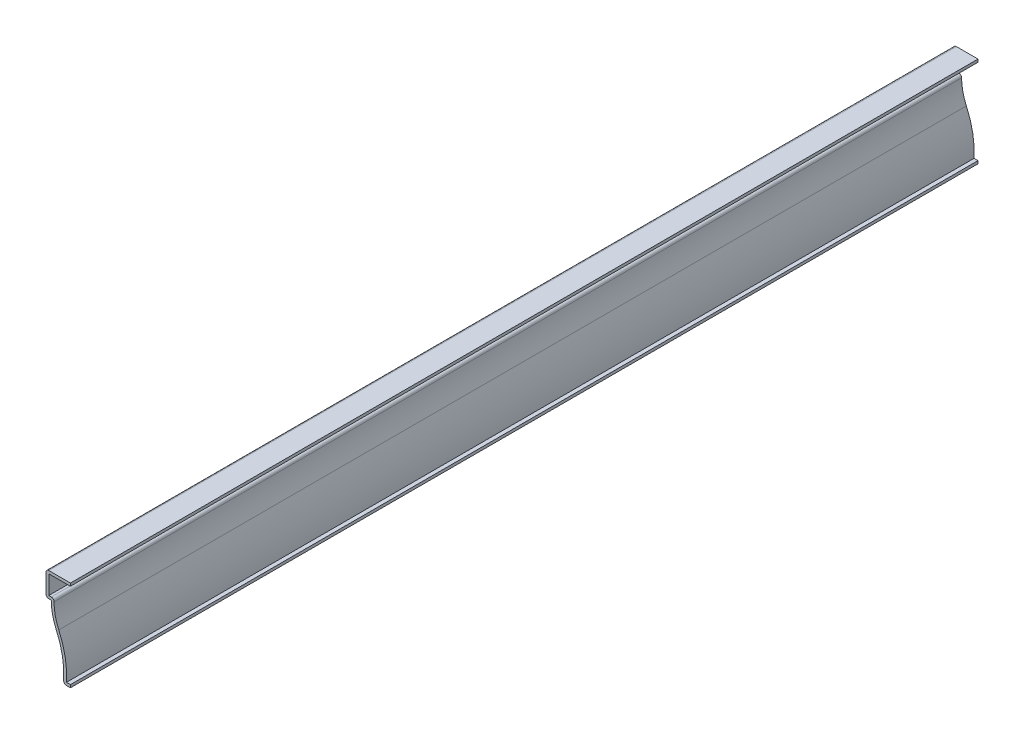
ISO-10303-21;
HEADER;
FILE_DESCRIPTION(('STEP AP214'),'2;1');
FILE_NAME('part.step','',(''),(''),'','','');
FILE_SCHEMA(('AUTOMOTIVE_DESIGN { 1 0 10303 214 1 1 1 1 }'));
ENDSEC;
DATA;
#1=APPLICATION_CONTEXT('core data for automotive mechanical design processes');
#2=APPLICATION_PROTOCOL_DEFINITION('international standard','automotive_design',2000,#1);
#3=PRODUCT_CONTEXT('',#1,'mechanical');
#4=PRODUCT('Part','Part','',(#3));
#5=PRODUCT_RELATED_PRODUCT_CATEGORY('part','',(#4));
#6=PRODUCT_DEFINITION_FORMATION('','',#4);
#7=PRODUCT_DEFINITION_CONTEXT('part definition',#1,'design');
#8=PRODUCT_DEFINITION('design','',#6,#7);
#9=PRODUCT_DEFINITION_SHAPE('','',#8);
#10=(LENGTH_UNIT() NAMED_UNIT(*) SI_UNIT(.MILLI.,.METRE.));
#11=(NAMED_UNIT(*) PLANE_ANGLE_UNIT() SI_UNIT($,.RADIAN.));
#12=(NAMED_UNIT(*) SI_UNIT($,.STERADIAN.) SOLID_ANGLE_UNIT());
#13=UNCERTAINTY_MEASURE_WITH_UNIT(LENGTH_MEASURE(1.E-05),#10,'distance_accuracy_value','');
#14=(GEOMETRIC_REPRESENTATION_CONTEXT(3) GLOBAL_UNCERTAINTY_ASSIGNED_CONTEXT((#13)) GLOBAL_UNIT_ASSIGNED_CONTEXT((#10,
#11,#12)) REPRESENTATION_CONTEXT('',''));
#15=CARTESIAN_POINT('',(0.,0.,0.));
#16=DIRECTION('',(0.,0.,1.));
#17=DIRECTION('',(1.,0.,0.));
#18=AXIS2_PLACEMENT_3D('',#15,#16,#17);
#19=CARTESIAN_POINT('',(-11.1125,40.005,-412.75));
#20=DIRECTION('',(0.,-1.,0.));
#21=DIRECTION('',(0.,0.,-1.));
#22=AXIS2_PLACEMENT_3D('',#19,#20,#21);
#23=PLANE('',#22);
#24=DIRECTION('',(1.,0.,0.));
#25=VECTOR('',#24,1.);
#26=CARTESIAN_POINT('',(-11.1125,40.005,0.));
#27=LINE('',#26,#25);
#28=CARTESIAN_POINT('',(-9.8425,40.005,0.));
#29=VERTEX_POINT('',#28);
#30=CARTESIAN_POINT('',(0.,40.005,0.));
#31=VERTEX_POINT('',#30);
#32=EDGE_CURVE('E218',#29,#31,#27,.T.);
#33=ORIENTED_EDGE('',*,*,#32,.F.);
#34=DIRECTION('',(0.,0.,1.));
#35=VECTOR('',#34,1.);
#36=CARTESIAN_POINT('',(-9.8425,40.005,-412.75));
#37=LINE('',#36,#35);
#38=CARTESIAN_POINT('',(-9.8425,40.005,-412.75));
#39=VERTEX_POINT('',#38);
#40=EDGE_CURVE('E185',#39,#29,#37,.T.);
#41=ORIENTED_EDGE('',*,*,#40,.F.);
#42=DIRECTION('',(1.,0.,0.));
#43=VECTOR('',#42,1.);
#44=CARTESIAN_POINT('',(-11.1125,40.005,-412.75));
#45=LINE('',#44,#43);
#46=CARTESIAN_POINT('',(0.,40.005,-412.75));
#47=VERTEX_POINT('',#46);
#48=EDGE_CURVE('E167',#39,#47,#45,.T.);
#49=ORIENTED_EDGE('',*,*,#48,.T.);
#50=DIRECTION('',(0.,0.,1.));
#51=VECTOR('',#50,1.);
#52=CARTESIAN_POINT('',(0.,40.005,-412.75));
#53=LINE('',#52,#51);
#54=EDGE_CURVE('E175',#47,#31,#53,.T.);
#55=ORIENTED_EDGE('',*,*,#54,.T.);
#56=EDGE_LOOP('',(#33,#41,#49,#55));
#57=FACE_BOUND('',#56,.T.);
#58=ADVANCED_FACE('F35',(#57),#23,.T.);
#59=CARTESIAN_POINT('',(-9.8425,30.1625,-412.75));
#60=DIRECTION('',(1.,0.,0.));
#61=DIRECTION('',(0.,0.,-1.));
#62=AXIS2_PLACEMENT_3D('',#59,#60,#61);
#63=PLANE('',#62);
#64=DIRECTION('',(0.,1.,0.));
#65=VECTOR('',#64,1.);
#66=CARTESIAN_POINT('',(-9.8425,30.1625,0.));
#67=LINE('',#66,#65);
#68=CARTESIAN_POINT('',(-9.8425,31.4325,0.));
#69=VERTEX_POINT('',#68);
#70=EDGE_CURVE('E186',#69,#29,#67,.T.);
#71=ORIENTED_EDGE('',*,*,#70,.F.);
#72=DIRECTION('',(0.,0.,1.));
#73=VECTOR('',#72,1.);
#74=CARTESIAN_POINT('',(-9.8425,31.4325,-412.75));
#75=LINE('',#74,#73);
#76=CARTESIAN_POINT('',(-9.8425,31.4325,-412.75));
#77=VERTEX_POINT('',#76);
#78=EDGE_CURVE('E249',#77,#69,#75,.T.);
#79=ORIENTED_EDGE('',*,*,#78,.F.);
#80=DIRECTION('',(0.,1.,0.));
#81=VECTOR('',#80,1.);
#82=CARTESIAN_POINT('',(-9.8425,30.1625,-412.75));
#83=LINE('',#82,#81);
#84=EDGE_CURVE('E183',#77,#39,#83,.T.);
#85=ORIENTED_EDGE('',*,*,#84,.T.);
#86=ORIENTED_EDGE('',*,*,#40,.T.);
#87=EDGE_LOOP('',(#71,#79,#85,#86));
#88=FACE_BOUND('',#87,.T.);
#89=ADVANCED_FACE('F320',(#88),#63,.T.);
#90=CARTESIAN_POINT('',(-8.73125,31.4325,-412.75));
#91=DIRECTION('',(0.,1.,0.));
#92=DIRECTION('',(-1.,0.,0.));
#93=AXIS2_PLACEMENT_3D('',#90,#91,#92);
#94=PLANE('',#93);
#95=DIRECTION('',(-1.,0.,0.));
#96=VECTOR('',#95,1.);
#97=CARTESIAN_POINT('',(-8.73125,31.4325,0.));
#98=LINE('',#97,#96);
#99=CARTESIAN_POINT('',(-8.73125,31.4325,0.));
#100=VERTEX_POINT('',#99);
#101=EDGE_CURVE('E189',#100,#69,#98,.T.);
#102=ORIENTED_EDGE('',*,*,#101,.F.);
#103=DIRECTION('',(0.,0.,1.));
#104=VECTOR('',#103,1.);
#105=CARTESIAN_POINT('',(-8.73125,31.4325,-412.75));
#106=LINE('',#105,#104);
#107=CARTESIAN_POINT('',(-8.73125,31.4325,-412.75));
#108=VERTEX_POINT('',#107);
#109=EDGE_CURVE('E290',#100,#108,#106,.F.);
#110=ORIENTED_EDGE('',*,*,#109,.T.);
#111=DIRECTION('',(-1.,0.,0.));
#112=VECTOR('',#111,1.);
#113=CARTESIAN_POINT('',(-8.73125,31.4325,-412.75));
#114=LINE('',#113,#112);
#115=EDGE_CURVE('E215',#108,#77,#114,.T.);
#116=ORIENTED_EDGE('',*,*,#115,.T.);
#117=ORIENTED_EDGE('',*,*,#78,.T.);
#118=EDGE_LOOP('',(#102,#110,#116,#117));
#119=FACE_BOUND('',#118,.T.);
#120=ADVANCED_FACE('F374',(#119),#94,.T.);
#121=CARTESIAN_POINT('',(16.66875,30.1625,-412.75));
#122=DIRECTION('',(0.,0.,1.));
#123=DIRECTION('',(1.,0.,0.));
#124=AXIS2_PLACEMENT_3D('',#121,#122,#123);
#125=CYLINDRICAL_SURFACE('',#124,24.13);
#126=CARTESIAN_POINT('',(16.66875,30.1625,-412.75));
#127=DIRECTION('',(0.,0.,1.));
#128=DIRECTION('',(1.,0.,0.));
#129=AXIS2_PLACEMENT_3D('',#126,#127,#128);
#130=CIRCLE('',#129,24.13);
#131=CARTESIAN_POINT('',(-5.2955052227266,20.1710840587569,-412.75));
#132=VERTEX_POINT('',#131);
#133=CARTESIAN_POINT('',(-7.46125,30.1625,-412.75));
#134=VERTEX_POINT('',#133);
#135=EDGE_CURVE('E212',#132,#134,#130,.F.);
#136=ORIENTED_EDGE('',*,*,#135,.T.);
#137=DIRECTION('',(0.,0.,1.));
#138=VECTOR('',#137,1.);
#139=CARTESIAN_POINT('',(-7.46125,30.1625,-412.75));
#140=LINE('',#139,#138);
#141=CARTESIAN_POINT('',(-7.46125,30.1625,0.));
#142=VERTEX_POINT('',#141);
#143=EDGE_CURVE('E287',#134,#142,#140,.T.);
#144=ORIENTED_EDGE('',*,*,#143,.T.);
#145=CARTESIAN_POINT('',(16.66875,30.1625,0.));
#146=DIRECTION('',(0.,0.,1.));
#147=DIRECTION('',(1.,0.,0.));
#148=AXIS2_PLACEMENT_3D('',#145,#146,#147);
#149=CIRCLE('',#148,24.13);
#150=CARTESIAN_POINT('',(-5.2955052227266,20.1710840587569,0.));
#151=VERTEX_POINT('',#150);
#152=EDGE_CURVE('E243',#151,#142,#149,.F.);
#153=ORIENTED_EDGE('',*,*,#152,.F.);
#154=DIRECTION('',(0.,0.,1.));
#155=VECTOR('',#154,1.);
#156=CARTESIAN_POINT('',(-5.2955052227266,20.1710840587569,-412.75));
#157=LINE('',#156,#155);
#158=EDGE_CURVE('E252',#132,#151,#157,.T.);
#159=ORIENTED_EDGE('',*,*,#158,.F.);
#160=EDGE_LOOP('',(#136,#144,#153,#159));
#161=FACE_BOUND('',#160,.T.);
#162=ADVANCED_FACE('F331',(#161),#125,.F.);
#163=CARTESIAN_POINT('',(-41.4931758364964,3.70496765558977,-412.75));
#164=DIRECTION('',(0.,0.,1.));
#165=DIRECTION('',(1.,0.,0.));
#166=AXIS2_PLACEMENT_3D('',#163,#164,#165);
#167=CYLINDRICAL_SURFACE('',#166,39.766875);
#168=CARTESIAN_POINT('',(-41.4931758364964,3.70496765558977,0.));
#169=DIRECTION('',(0.,0.,1.));
#170=DIRECTION('',(1.,0.,0.));
#171=AXIS2_PLACEMENT_3D('',#168,#169,#170);
#172=CIRCLE('',#171,39.766875);
#173=CARTESIAN_POINT('',(-1.80091865978933,1.27,0.));
#174=VERTEX_POINT('',#173);
#175=EDGE_CURVE('E240',#174,#151,#172,.T.);
#176=ORIENTED_EDGE('',*,*,#175,.F.);
#177=DIRECTION('',(0.,0.,1.));
#178=VECTOR('',#177,1.);
#179=CARTESIAN_POINT('',(-1.80091865978933,1.27,-412.75));
#180=LINE('',#179,#178);
#181=CARTESIAN_POINT('',(-1.80091865978933,1.27,-412.75));
#182=VERTEX_POINT('',#181);
#183=EDGE_CURVE('E254',#182,#174,#180,.T.);
#184=ORIENTED_EDGE('',*,*,#183,.F.);
#185=CARTESIAN_POINT('',(-41.4931758364964,3.70496765558977,-412.75));
#186=DIRECTION('',(0.,0.,1.));
#187=DIRECTION('',(1.,0.,0.));
#188=AXIS2_PLACEMENT_3D('',#185,#186,#187);
#189=CIRCLE('',#188,39.766875);
#190=EDGE_CURVE('E209',#182,#132,#189,.T.);
#191=ORIENTED_EDGE('',*,*,#190,.T.);
#192=ORIENTED_EDGE('',*,*,#158,.T.);
#193=EDGE_LOOP('',(#176,#184,#191,#192));
#194=FACE_BOUND('',#193,.T.);
#195=ADVANCED_FACE('F336',(#194),#167,.T.);
#196=CARTESIAN_POINT('',(0.,1.27,-412.75));
#197=DIRECTION('',(0.,1.,0.));
#198=DIRECTION('',(-1.,0.,0.));
#199=AXIS2_PLACEMENT_3D('',#196,#197,#198);
#200=PLANE('',#199);
#201=DIRECTION('',(-1.,0.,0.));
#202=VECTOR('',#201,1.);
#203=CARTESIAN_POINT('',(0.,1.27,0.));
#204=LINE('',#203,#202);
#205=CARTESIAN_POINT('',(0.,1.27,0.));
#206=VERTEX_POINT('',#205);
#207=EDGE_CURVE('E237',#206,#174,#204,.T.);
#208=ORIENTED_EDGE('',*,*,#207,.F.);
#209=DIRECTION('',(0.,0.,1.));
#210=VECTOR('',#209,1.);
#211=CARTESIAN_POINT('',(0.,1.27,-412.75));
#212=LINE('',#211,#210);
#213=CARTESIAN_POINT('',(0.,1.27,-412.75));
#214=VERTEX_POINT('',#213);
#215=EDGE_CURVE('E256',#214,#206,#212,.T.);
#216=ORIENTED_EDGE('',*,*,#215,.F.);
#217=DIRECTION('',(-1.,0.,0.));
#218=VECTOR('',#217,1.);
#219=CARTESIAN_POINT('',(0.,1.27,-412.75));
#220=LINE('',#219,#218);
#221=EDGE_CURVE('E206',#214,#182,#220,.T.);
#222=ORIENTED_EDGE('',*,*,#221,.T.);
#223=ORIENTED_EDGE('',*,*,#183,.T.);
#224=EDGE_LOOP('',(#208,#216,#222,#223));
#225=FACE_BOUND('',#224,.T.);
#226=ADVANCED_FACE('F340',(#225),#200,.T.);
#227=CARTESIAN_POINT('',(0.,1.27,-412.75));
#228=DIRECTION('',(-1.,0.,0.));
#229=DIRECTION('',(0.,-1.,0.));
#230=AXIS2_PLACEMENT_3D('',#227,#228,#229);
#231=PLANE('',#230);
#232=DIRECTION('',(0.,-1.,0.));
#233=VECTOR('',#232,1.);
#234=CARTESIAN_POINT('',(0.,1.27,0.));
#235=LINE('',#234,#233);
#236=CARTESIAN_POINT('',(0.,0.,0.));
#237=VERTEX_POINT('',#236);
#238=EDGE_CURVE('E235',#206,#237,#235,.T.);
#239=ORIENTED_EDGE('',*,*,#238,.T.);
#240=DIRECTION('',(0.,0.,1.));
#241=VECTOR('',#240,1.);
#242=CARTESIAN_POINT('',(0.,0.,-412.75));
#243=LINE('',#242,#241);
#244=CARTESIAN_POINT('',(0.,0.,-412.75));
#245=VERTEX_POINT('',#244);
#246=EDGE_CURVE('E258',#245,#237,#243,.T.);
#247=ORIENTED_EDGE('',*,*,#246,.F.);
#248=DIRECTION('',(0.,-1.,0.));
#249=VECTOR('',#248,1.);
#250=CARTESIAN_POINT('',(0.,1.27,-412.75));
#251=LINE('',#250,#249);
#252=EDGE_CURVE('E204',#214,#245,#251,.T.);
#253=ORIENTED_EDGE('',*,*,#252,.F.);
#254=ORIENTED_EDGE('',*,*,#215,.T.);
#255=EDGE_LOOP('',(#239,#247,#253,#254));
#256=FACE_BOUND('',#255,.T.);
#257=ADVANCED_FACE('F344',(#256),#231,.F.);
#258=CARTESIAN_POINT('',(0.,0.,-412.75));
#259=DIRECTION('',(0.,1.,0.));
#260=DIRECTION('',(-1.,0.,0.));
#261=AXIS2_PLACEMENT_3D('',#258,#259,#260);
#262=PLANE('',#261);
#263=DIRECTION('',(-1.,0.,0.));
#264=VECTOR('',#263,1.);
#265=CARTESIAN_POINT('',(0.,0.,0.));
#266=LINE('',#265,#264);
#267=CARTESIAN_POINT('',(-1.80091865978933,0.,0.));
#268=VERTEX_POINT('',#267);
#269=EDGE_CURVE('E232',#237,#268,#266,.T.);
#270=ORIENTED_EDGE('',*,*,#269,.T.);
#271=DIRECTION('',(0.,0.,1.));
#272=VECTOR('',#271,1.);
#273=CARTESIAN_POINT('',(-1.80091865978933,0.,-412.75));
#274=LINE('',#273,#272);
#275=CARTESIAN_POINT('',(-1.80091865978933,0.,-412.75));
#276=VERTEX_POINT('',#275);
#277=EDGE_CURVE('E278',#268,#276,#274,.F.);
#278=ORIENTED_EDGE('',*,*,#277,.T.);
#279=DIRECTION('',(-1.,0.,0.));
#280=VECTOR('',#279,1.);
#281=CARTESIAN_POINT('',(0.,0.,-412.75));
#282=LINE('',#281,#280);
#283=EDGE_CURVE('E202',#245,#276,#282,.T.);
#284=ORIENTED_EDGE('',*,*,#283,.F.);
#285=ORIENTED_EDGE('',*,*,#246,.T.);
#286=EDGE_LOOP('',(#270,#278,#284,#285));
#287=FACE_BOUND('',#286,.T.);
#288=ADVANCED_FACE('F367',(#287),#262,.F.);
#289=CARTESIAN_POINT('',(-41.4931758364964,3.70496765558977,-412.75));
#290=DIRECTION('',(0.,0.,1.));
#291=DIRECTION('',(1.,0.,0.));
#292=AXIS2_PLACEMENT_3D('',#289,#290,#291);
#293=CYLINDRICAL_SURFACE('',#292,38.496875);
#294=CARTESIAN_POINT('',(-41.4931758364964,3.70496765558977,-412.75));
#295=DIRECTION('',(0.,0.,1.));
#296=DIRECTION('',(1.,0.,0.));
#297=AXIS2_PLACEMENT_3D('',#294,#295,#296);
#298=CIRCLE('',#297,38.496875);
#299=CARTESIAN_POINT('',(-3.06853565545263,1.34776343810267,-412.75));
#300=VERTEX_POINT('',#299);
#301=CARTESIAN_POINT('',(-6.45151865550168,19.6452200618493,-412.75));
#302=VERTEX_POINT('',#301);
#303=EDGE_CURVE('E200',#300,#302,#298,.T.);
#304=ORIENTED_EDGE('',*,*,#303,.F.);
#305=DIRECTION('',(0.,0.,1.));
#306=VECTOR('',#305,1.);
#307=CARTESIAN_POINT('',(-3.06853565545262,1.34776343810267,-412.75));
#308=LINE('',#307,#306);
#309=CARTESIAN_POINT('',(-3.06853565545263,1.34776343810267,0.));
#310=VERTEX_POINT('',#309);
#311=EDGE_CURVE('E248',#300,#310,#308,.T.);
#312=ORIENTED_EDGE('',*,*,#311,.T.);
#313=CARTESIAN_POINT('',(-41.4931758364964,3.70496765558977,0.));
#314=DIRECTION('',(0.,0.,1.));
#315=DIRECTION('',(1.,0.,0.));
#316=AXIS2_PLACEMENT_3D('',#313,#314,#315);
#317=CIRCLE('',#316,38.496875);
#318=CARTESIAN_POINT('',(-6.45151865550168,19.6452200618493,0.));
#319=VERTEX_POINT('',#318);
#320=EDGE_CURVE('E230',#310,#319,#317,.T.);
#321=ORIENTED_EDGE('',*,*,#320,.T.);
#322=DIRECTION('',(0.,0.,1.));
#323=VECTOR('',#322,1.);
#324=CARTESIAN_POINT('',(-6.45151865550168,19.6452200618493,-412.75));
#325=LINE('',#324,#323);
#326=EDGE_CURVE('E261',#302,#319,#325,.T.);
#327=ORIENTED_EDGE('',*,*,#326,.F.);
#328=EDGE_LOOP('',(#304,#312,#321,#327));
#329=FACE_BOUND('',#328,.T.);
#330=ADVANCED_FACE('F354',(#329),#293,.F.);
#331=CARTESIAN_POINT('',(16.66875,30.1625,-412.75));
#332=DIRECTION('',(0.,0.,1.));
#333=DIRECTION('',(1.,0.,0.));
#334=AXIS2_PLACEMENT_3D('',#331,#332,#333);
#335=CYLINDRICAL_SURFACE('',#334,25.4);
#336=CARTESIAN_POINT('',(16.66875,30.1625,0.));
#337=DIRECTION('',(0.,0.,-1.));
#338=DIRECTION('',(-1.,0.,0.));
#339=AXIS2_PLACEMENT_3D('',#336,#337,#338);
#340=CIRCLE('',#339,25.4);
#341=CARTESIAN_POINT('',(-8.73125,30.1625,0.));
#342=VERTEX_POINT('',#341);
#343=EDGE_CURVE('E228',#319,#342,#340,.T.);
#344=ORIENTED_EDGE('',*,*,#343,.T.);
#345=DIRECTION('',(0.,0.,1.));
#346=VECTOR('',#345,1.);
#347=CARTESIAN_POINT('',(-8.73125,30.1625,-412.75));
#348=LINE('',#347,#346);
#349=CARTESIAN_POINT('',(-8.73125,30.1625,-412.75));
#350=VERTEX_POINT('',#349);
#351=EDGE_CURVE('E264',#350,#342,#348,.T.);
#352=ORIENTED_EDGE('',*,*,#351,.F.);
#353=CARTESIAN_POINT('',(16.66875,30.1625,-412.75));
#354=DIRECTION('',(0.,0.,-1.));
#355=DIRECTION('',(-1.,0.,0.));
#356=AXIS2_PLACEMENT_3D('',#353,#354,#355);
#357=CIRCLE('',#356,25.4);
#358=EDGE_CURVE('E198',#302,#350,#357,.T.);
#359=ORIENTED_EDGE('',*,*,#358,.F.);
#360=ORIENTED_EDGE('',*,*,#326,.T.);
#361=EDGE_LOOP('',(#344,#352,#359,#360));
#362=FACE_BOUND('',#361,.T.);
#363=ADVANCED_FACE('F359',(#362),#335,.T.);
#364=CARTESIAN_POINT('',(-8.73125,30.1625,-412.75));
#365=DIRECTION('',(0.,1.,0.));
#366=DIRECTION('',(-1.,0.,0.));
#367=AXIS2_PLACEMENT_3D('',#364,#365,#366);
#368=PLANE('',#367);
#369=DIRECTION('',(-1.,0.,0.));
#370=VECTOR('',#369,1.);
#371=CARTESIAN_POINT('',(-8.73125,30.1625,0.));
#372=LINE('',#371,#370);
#373=CARTESIAN_POINT('',(-9.8425,30.1625,0.));
#374=VERTEX_POINT('',#373);
#375=EDGE_CURVE('E225',#342,#374,#372,.T.);
#376=ORIENTED_EDGE('',*,*,#375,.T.);
#377=DIRECTION('',(0.,0.,1.));
#378=VECTOR('',#377,1.);
#379=CARTESIAN_POINT('',(-9.8425,30.1625,-412.75));
#380=LINE('',#379,#378);
#381=CARTESIAN_POINT('',(-9.8425,30.1625,-412.75));
#382=VERTEX_POINT('',#381);
#383=EDGE_CURVE('E43',#374,#382,#380,.F.);
#384=ORIENTED_EDGE('',*,*,#383,.T.);
#385=DIRECTION('',(-1.,0.,0.));
#386=VECTOR('',#385,1.);
#387=CARTESIAN_POINT('',(-8.73125,30.1625,-412.75));
#388=LINE('',#387,#386);
#389=EDGE_CURVE('E195',#350,#382,#388,.T.);
#390=ORIENTED_EDGE('',*,*,#389,.F.);
#391=ORIENTED_EDGE('',*,*,#351,.T.);
#392=EDGE_LOOP('',(#376,#384,#390,#391));
#393=FACE_BOUND('',#392,.T.);
#394=ADVANCED_FACE('F298',(#393),#368,.F.);
#395=CARTESIAN_POINT('',(-11.1125,30.1625,-412.75));
#396=DIRECTION('',(1.,0.,0.));
#397=DIRECTION('',(0.,0.,-1.));
#398=AXIS2_PLACEMENT_3D('',#395,#396,#397);
#399=PLANE('',#398);
#400=DIRECTION('',(0.,1.,0.));
#401=VECTOR('',#400,1.);
#402=CARTESIAN_POINT('',(-11.1125,30.1625,-412.75));
#403=LINE('',#402,#401);
#404=CARTESIAN_POINT('',(-11.1125,31.4325,-412.75));
#405=VERTEX_POINT('',#404);
#406=CARTESIAN_POINT('',(-11.1125,40.005,-412.75));
#407=VERTEX_POINT('',#406);
#408=EDGE_CURVE('E193',#405,#407,#403,.T.);
#409=ORIENTED_EDGE('',*,*,#408,.F.);
#410=DIRECTION('',(0.,0.,1.));
#411=VECTOR('',#410,1.);
#412=CARTESIAN_POINT('',(-11.1125,31.4325,-412.75));
#413=LINE('',#412,#411);
#414=CARTESIAN_POINT('',(-11.1125,31.4325,0.));
#415=VERTEX_POINT('',#414);
#416=EDGE_CURVE('E293',#405,#415,#413,.T.);
#417=ORIENTED_EDGE('',*,*,#416,.T.);
#418=DIRECTION('',(0.,1.,0.));
#419=VECTOR('',#418,1.);
#420=CARTESIAN_POINT('',(-11.1125,30.1625,0.));
#421=LINE('',#420,#419);
#422=CARTESIAN_POINT('',(-11.1125,40.005,0.));
#423=VERTEX_POINT('',#422);
#424=EDGE_CURVE('E223',#415,#423,#421,.T.);
#425=ORIENTED_EDGE('',*,*,#424,.T.);
#426=DIRECTION('',(0.,0.,1.));
#427=VECTOR('',#426,1.);
#428=CARTESIAN_POINT('',(-11.1125,40.005,-412.75));
#429=LINE('',#428,#427);
#430=EDGE_CURVE('E58',#423,#407,#429,.F.);
#431=ORIENTED_EDGE('',*,*,#430,.T.);
#432=EDGE_LOOP('',(#409,#417,#425,#431));
#433=FACE_BOUND('',#432,.T.);
#434=ADVANCED_FACE('F307',(#433),#399,.F.);
#435=CARTESIAN_POINT('',(-11.1125,41.275,-412.75));
#436=DIRECTION('',(0.,-1.,0.));
#437=DIRECTION('',(0.,0.,-1.));
#438=AXIS2_PLACEMENT_3D('',#435,#436,#437);
#439=PLANE('',#438);
#440=DIRECTION('',(1.,0.,0.));
#441=VECTOR('',#440,1.);
#442=CARTESIAN_POINT('',(-11.1125,41.275,-412.75));
#443=LINE('',#442,#441);
#444=CARTESIAN_POINT('',(-9.8425,41.275,-412.75));
#445=VERTEX_POINT('',#444);
#446=CARTESIAN_POINT('',(0.,41.275,-412.75));
#447=VERTEX_POINT('',#446);
#448=EDGE_CURVE('E169',#445,#447,#443,.T.);
#449=ORIENTED_EDGE('',*,*,#448,.F.);
#450=DIRECTION('',(0.,0.,1.));
#451=VECTOR('',#450,1.);
#452=CARTESIAN_POINT('',(-9.8425,41.275,-412.75));
#453=LINE('',#452,#451);
#454=CARTESIAN_POINT('',(-9.8425,41.275,0.));
#455=VERTEX_POINT('',#454);
#456=EDGE_CURVE('E11',#445,#455,#453,.T.);
#457=ORIENTED_EDGE('',*,*,#456,.T.);
#458=DIRECTION('',(1.,0.,0.));
#459=VECTOR('',#458,1.);
#460=CARTESIAN_POINT('',(-11.1125,41.275,0.));
#461=LINE('',#460,#459);
#462=CARTESIAN_POINT('',(0.,41.275,0.));
#463=VERTEX_POINT('',#462);
#464=EDGE_CURVE('E221',#455,#463,#461,.T.);
#465=ORIENTED_EDGE('',*,*,#464,.T.);
#466=DIRECTION('',(0.,0.,1.));
#467=VECTOR('',#466,1.);
#468=CARTESIAN_POINT('',(0.,41.275,-412.75));
#469=LINE('',#468,#467);
#470=EDGE_CURVE('E182',#447,#463,#469,.T.);
#471=ORIENTED_EDGE('',*,*,#470,.F.);
#472=EDGE_LOOP('',(#449,#457,#465,#471));
#473=FACE_BOUND('',#472,.T.);
#474=ADVANCED_FACE('F315',(#473),#439,.F.);
#475=CARTESIAN_POINT('',(0.,41.275,-412.75));
#476=DIRECTION('',(-1.,0.,0.));
#477=DIRECTION('',(0.,0.,1.));
#478=AXIS2_PLACEMENT_3D('',#475,#476,#477);
#479=PLANE('',#478);
#480=DIRECTION('',(0.,-1.,0.));
#481=VECTOR('',#480,1.);
#482=CARTESIAN_POINT('',(0.,41.275,0.));
#483=LINE('',#482,#481);
#484=EDGE_CURVE('E178',#463,#31,#483,.T.);
#485=ORIENTED_EDGE('',*,*,#484,.T.);
#486=ORIENTED_EDGE('',*,*,#54,.F.);
#487=DIRECTION('',(0.,-1.,0.));
#488=VECTOR('',#487,1.);
#489=CARTESIAN_POINT('',(0.,41.275,-412.75));
#490=LINE('',#489,#488);
#491=EDGE_CURVE('E161',#447,#47,#490,.T.);
#492=ORIENTED_EDGE('',*,*,#491,.F.);
#493=ORIENTED_EDGE('',*,*,#470,.T.);
#494=EDGE_LOOP('',(#485,#486,#492,#493));
#495=FACE_BOUND('',#494,.T.);
#496=ADVANCED_FACE('F176',(#495),#479,.F.);
#497=CARTESIAN_POINT('',(16.66875,30.1625,-412.75));
#498=DIRECTION('',(0.,0.,-1.));
#499=DIRECTION('',(-1.,0.,0.));
#500=AXIS2_PLACEMENT_3D('',#497,#498,#499);
#501=PLANE('',#500);
#502=ORIENTED_EDGE('',*,*,#283,.T.);
#503=CARTESIAN_POINT('',(-1.80091865978933,1.27,-412.75));
#504=DIRECTION('',(0.,0.,-1.));
#505=DIRECTION('',(-1.,0.,0.));
#506=AXIS2_PLACEMENT_3D('',#503,#504,#505);
#507=CIRCLE('',#506,1.27);
#508=EDGE_CURVE('E285',#276,#300,#507,.T.);
#509=ORIENTED_EDGE('',*,*,#508,.T.);
#510=ORIENTED_EDGE('',*,*,#303,.T.);
#511=ORIENTED_EDGE('',*,*,#358,.T.);
#512=ORIENTED_EDGE('',*,*,#389,.T.);
#513=CARTESIAN_POINT('',(-9.8425,31.4325,-412.75));
#514=DIRECTION('',(0.,0.,-1.));
#515=DIRECTION('',(-1.,0.,0.));
#516=AXIS2_PLACEMENT_3D('',#513,#514,#515);
#517=CIRCLE('',#516,1.27);
#518=EDGE_CURVE('E281',#382,#405,#517,.T.);
#519=ORIENTED_EDGE('',*,*,#518,.T.);
#520=ORIENTED_EDGE('',*,*,#408,.T.);
#521=CARTESIAN_POINT('',(-9.8425,40.005,-412.75));
#522=DIRECTION('',(0.,0.,-1.));
#523=DIRECTION('',(-1.,0.,0.));
#524=AXIS2_PLACEMENT_3D('',#521,#522,#523);
#525=CIRCLE('',#524,1.27);
#526=EDGE_CURVE('E50',#407,#445,#525,.T.);
#527=ORIENTED_EDGE('',*,*,#526,.T.);
#528=ORIENTED_EDGE('',*,*,#448,.T.);
#529=ORIENTED_EDGE('',*,*,#491,.T.);
#530=ORIENTED_EDGE('',*,*,#48,.F.);
#531=ORIENTED_EDGE('',*,*,#84,.F.);
#532=ORIENTED_EDGE('',*,*,#115,.F.);
#533=CARTESIAN_POINT('',(-8.73125,30.1625,-412.75));
#534=DIRECTION('',(0.,0.,-1.));
#535=DIRECTION('',(-1.,0.,0.));
#536=AXIS2_PLACEMENT_3D('',#533,#534,#535);
#537=CIRCLE('',#536,1.27);
#538=EDGE_CURVE('E283',#108,#134,#537,.T.);
#539=ORIENTED_EDGE('',*,*,#538,.T.);
#540=ORIENTED_EDGE('',*,*,#135,.F.);
#541=ORIENTED_EDGE('',*,*,#190,.F.);
#542=ORIENTED_EDGE('',*,*,#221,.F.);
#543=ORIENTED_EDGE('',*,*,#252,.T.);
#544=EDGE_LOOP('',(#502,#509,#510,#511,#512,#519,#520,#527,#528,#529,#530,#531,#532,#539,#540,
#541,#542,#543));
#545=FACE_BOUND('',#544,.T.);
#546=ADVANCED_FACE('F164',(#545),#501,.T.);
#547=CARTESIAN_POINT('',(16.66875,30.1625,0.));
#548=DIRECTION('',(0.,0.,-1.));
#549=DIRECTION('',(-1.,0.,0.));
#550=AXIS2_PLACEMENT_3D('',#547,#548,#549);
#551=PLANE('',#550);
#552=ORIENTED_EDGE('',*,*,#320,.F.);
#553=CARTESIAN_POINT('',(-1.80091865978933,1.27,0.));
#554=DIRECTION('',(0.,0.,-1.));
#555=DIRECTION('',(-1.,0.,0.));
#556=AXIS2_PLACEMENT_3D('',#553,#554,#555);
#557=CIRCLE('',#556,1.27);
#558=EDGE_CURVE('E276',#310,#268,#557,.F.);
#559=ORIENTED_EDGE('',*,*,#558,.T.);
#560=ORIENTED_EDGE('',*,*,#269,.F.);
#561=ORIENTED_EDGE('',*,*,#238,.F.);
#562=ORIENTED_EDGE('',*,*,#207,.T.);
#563=ORIENTED_EDGE('',*,*,#175,.T.);
#564=ORIENTED_EDGE('',*,*,#152,.T.);
#565=CARTESIAN_POINT('',(-8.73125,30.1625,0.));
#566=DIRECTION('',(0.,0.,-1.));
#567=DIRECTION('',(-1.,0.,0.));
#568=AXIS2_PLACEMENT_3D('',#565,#566,#567);
#569=CIRCLE('',#568,1.27);
#570=EDGE_CURVE('E274',#142,#100,#569,.F.);
#571=ORIENTED_EDGE('',*,*,#570,.T.);
#572=ORIENTED_EDGE('',*,*,#101,.T.);
#573=ORIENTED_EDGE('',*,*,#70,.T.);
#574=ORIENTED_EDGE('',*,*,#32,.T.);
#575=ORIENTED_EDGE('',*,*,#484,.F.);
#576=ORIENTED_EDGE('',*,*,#464,.F.);
#577=CARTESIAN_POINT('',(-9.8425,40.005,0.));
#578=DIRECTION('',(0.,0.,-1.));
#579=DIRECTION('',(-1.,0.,0.));
#580=AXIS2_PLACEMENT_3D('',#577,#578,#579);
#581=CIRCLE('',#580,1.27);
#582=EDGE_CURVE('E270',#455,#423,#581,.F.);
#583=ORIENTED_EDGE('',*,*,#582,.T.);
#584=ORIENTED_EDGE('',*,*,#424,.F.);
#585=CARTESIAN_POINT('',(-9.8425,31.4325,0.));
#586=DIRECTION('',(0.,0.,-1.));
#587=DIRECTION('',(-1.,0.,0.));
#588=AXIS2_PLACEMENT_3D('',#585,#586,#587);
#589=CIRCLE('',#588,1.27);
#590=EDGE_CURVE('E272',#415,#374,#589,.F.);
#591=ORIENTED_EDGE('',*,*,#590,.T.);
#592=ORIENTED_EDGE('',*,*,#375,.F.);
#593=ORIENTED_EDGE('',*,*,#343,.F.);
#594=EDGE_LOOP('',(#552,#559,#560,#561,#562,#563,#564,#571,#572,#573,#574,#575,#576,#583,#584,
#591,#592,#593));
#595=FACE_BOUND('',#594,.T.);
#596=ADVANCED_FACE('F310',(#595),#551,.F.);
#597=CARTESIAN_POINT('',(-1.80091865978933,1.27,-412.75));
#598=DIRECTION('',(0.,0.,1.));
#599=DIRECTION('',(1.,0.,0.));
#600=AXIS2_PLACEMENT_3D('',#597,#598,#599);
#601=CYLINDRICAL_SURFACE('',#600,1.27);
#602=ORIENTED_EDGE('',*,*,#508,.F.);
#603=ORIENTED_EDGE('',*,*,#277,.F.);
#604=ORIENTED_EDGE('',*,*,#558,.F.);
#605=ORIENTED_EDGE('',*,*,#311,.F.);
#606=EDGE_LOOP('',(#602,#603,#604,#605));
#607=FACE_BOUND('',#606,.T.);
#608=ADVANCED_FACE('F352',(#607),#601,.T.);
#609=CARTESIAN_POINT('',(-8.73125,30.1625,-412.75));
#610=DIRECTION('',(0.,0.,1.));
#611=DIRECTION('',(1.,0.,0.));
#612=AXIS2_PLACEMENT_3D('',#609,#610,#611);
#613=CYLINDRICAL_SURFACE('',#612,1.27);
#614=ORIENTED_EDGE('',*,*,#538,.F.);
#615=ORIENTED_EDGE('',*,*,#109,.F.);
#616=ORIENTED_EDGE('',*,*,#570,.F.);
#617=ORIENTED_EDGE('',*,*,#143,.F.);
#618=EDGE_LOOP('',(#614,#615,#616,#617));
#619=FACE_BOUND('',#618,.T.);
#620=ADVANCED_FACE('F328',(#619),#613,.T.);
#621=CARTESIAN_POINT('',(-9.8425,31.4325,-412.75));
#622=DIRECTION('',(0.,0.,1.));
#623=DIRECTION('',(1.,0.,0.));
#624=AXIS2_PLACEMENT_3D('',#621,#622,#623);
#625=CYLINDRICAL_SURFACE('',#624,1.27);
#626=ORIENTED_EDGE('',*,*,#518,.F.);
#627=ORIENTED_EDGE('',*,*,#383,.F.);
#628=ORIENTED_EDGE('',*,*,#590,.F.);
#629=ORIENTED_EDGE('',*,*,#416,.F.);
#630=EDGE_LOOP('',(#626,#627,#628,#629));
#631=FACE_BOUND('',#630,.T.);
#632=ADVANCED_FACE('F305',(#631),#625,.T.);
#633=CARTESIAN_POINT('',(-9.8425,40.005,-412.75));
#634=DIRECTION('',(0.,0.,1.));
#635=DIRECTION('',(1.,0.,0.));
#636=AXIS2_PLACEMENT_3D('',#633,#634,#635);
#637=CYLINDRICAL_SURFACE('',#636,1.27);
#638=ORIENTED_EDGE('',*,*,#526,.F.);
#639=ORIENTED_EDGE('',*,*,#430,.F.);
#640=ORIENTED_EDGE('',*,*,#582,.F.);
#641=ORIENTED_EDGE('',*,*,#456,.F.);
#642=EDGE_LOOP('',(#638,#639,#640,#641));
#643=FACE_BOUND('',#642,.T.);
#644=ADVANCED_FACE('F37',(#643),#637,.T.);
#645=CLOSED_SHELL('',(#58,#89,#120,#162,#195,#226,#257,#288,#330,#363,#394,#434,#474,#496,#546,
#596,#608,#620,#632,#644));
#646=MANIFOLD_SOLID_BREP('B2',#645);
#647=ADVANCED_BREP_SHAPE_REPRESENTATION('',(#18,#646),#14);
#648=SHAPE_DEFINITION_REPRESENTATION(#9,#647);
ENDSEC;
END-ISO-10303-21;
